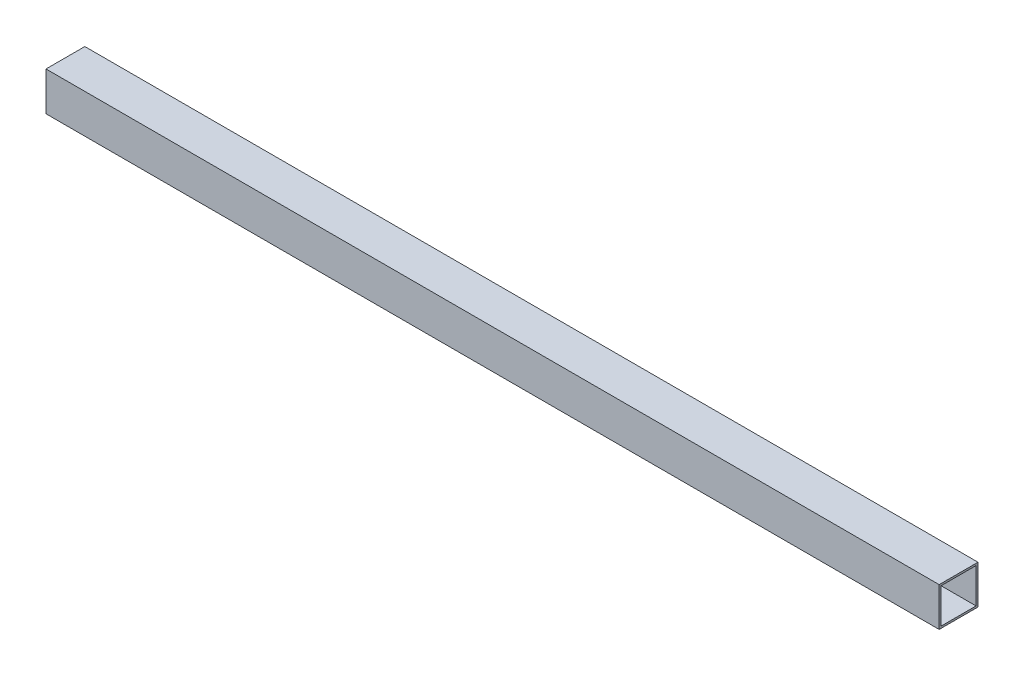
ISO-10303-21;
HEADER;
FILE_DESCRIPTION(('STEP AP214'),'2;1');
FILE_NAME('part.step','',(''),(''),'','','');
FILE_SCHEMA(('AUTOMOTIVE_DESIGN { 1 0 10303 214 1 1 1 1 }'));
ENDSEC;
DATA;
#1=APPLICATION_CONTEXT('core data for automotive mechanical design processes');
#2=APPLICATION_PROTOCOL_DEFINITION('international standard','automotive_design',2000,#1);
#3=PRODUCT_CONTEXT('',#1,'mechanical');
#4=PRODUCT('Part','Part','',(#3));
#5=PRODUCT_RELATED_PRODUCT_CATEGORY('part','',(#4));
#6=PRODUCT_DEFINITION_FORMATION('','',#4);
#7=PRODUCT_DEFINITION_CONTEXT('part definition',#1,'design');
#8=PRODUCT_DEFINITION('design','',#6,#7);
#9=PRODUCT_DEFINITION_SHAPE('','',#8);
#10=(LENGTH_UNIT() NAMED_UNIT(*) SI_UNIT(.MILLI.,.METRE.));
#11=(NAMED_UNIT(*) PLANE_ANGLE_UNIT() SI_UNIT($,.RADIAN.));
#12=(NAMED_UNIT(*) SI_UNIT($,.STERADIAN.) SOLID_ANGLE_UNIT());
#13=UNCERTAINTY_MEASURE_WITH_UNIT(LENGTH_MEASURE(1.E-05),#10,'distance_accuracy_value','');
#14=(GEOMETRIC_REPRESENTATION_CONTEXT(3) GLOBAL_UNCERTAINTY_ASSIGNED_CONTEXT((#13)) GLOBAL_UNIT_ASSIGNED_CONTEXT((#10,
#11,#12)) REPRESENTATION_CONTEXT('',''));
#15=CARTESIAN_POINT('',(0.,0.,0.));
#16=DIRECTION('',(0.,0.,1.));
#17=DIRECTION('',(1.,0.,0.));
#18=AXIS2_PLACEMENT_3D('',#15,#16,#17);
#19=CARTESIAN_POINT('',(920.,0.,0.));
#20=DIRECTION('',(-1.,0.,0.));
#21=DIRECTION('',(0.,0.,1.));
#22=AXIS2_PLACEMENT_3D('',#19,#20,#21);
#23=PLANE('',#22);
#24=DIRECTION('',(0.,1.,0.));
#25=VECTOR('',#24,1.);
#26=CARTESIAN_POINT('',(920.,-20.,-20.));
#27=LINE('',#26,#25);
#28=CARTESIAN_POINT('',(920.,-20.,-20.));
#29=VERTEX_POINT('',#28);
#30=CARTESIAN_POINT('',(920.,20.,-20.));
#31=VERTEX_POINT('',#30);
#32=EDGE_CURVE('E133',#29,#31,#27,.T.);
#33=ORIENTED_EDGE('',*,*,#32,.T.);
#34=DIRECTION('',(0.,0.,1.));
#35=VECTOR('',#34,1.);
#36=CARTESIAN_POINT('',(920.,20.,20.));
#37=LINE('',#36,#35);
#38=CARTESIAN_POINT('',(920.,20.,20.));
#39=VERTEX_POINT('',#38);
#40=EDGE_CURVE('E136',#31,#39,#37,.T.);
#41=ORIENTED_EDGE('',*,*,#40,.T.);
#42=DIRECTION('',(0.,-1.,0.));
#43=VECTOR('',#42,1.);
#44=CARTESIAN_POINT('',(920.,-20.,20.));
#45=LINE('',#44,#43);
#46=CARTESIAN_POINT('',(920.,-20.,20.));
#47=VERTEX_POINT('',#46);
#48=EDGE_CURVE('E139',#39,#47,#45,.T.);
#49=ORIENTED_EDGE('',*,*,#48,.T.);
#50=DIRECTION('',(0.,0.,-1.));
#51=VECTOR('',#50,1.);
#52=CARTESIAN_POINT('',(920.,-20.,20.));
#53=LINE('',#52,#51);
#54=EDGE_CURVE('E141',#47,#29,#53,.T.);
#55=ORIENTED_EDGE('',*,*,#54,.T.);
#56=EDGE_LOOP('',(#33,#41,#49,#55));
#57=FACE_BOUND('',#56,.T.);
#58=DIRECTION('',(0.,1.,0.));
#59=VECTOR('',#58,1.);
#60=CARTESIAN_POINT('',(920.,-18.,-18.));
#61=LINE('',#60,#59);
#62=CARTESIAN_POINT('',(920.,-18.,-18.));
#63=VERTEX_POINT('',#62);
#64=CARTESIAN_POINT('',(920.,18.,-18.));
#65=VERTEX_POINT('',#64);
#66=EDGE_CURVE('E97',#63,#65,#61,.T.);
#67=ORIENTED_EDGE('',*,*,#66,.F.);
#68=DIRECTION('',(0.,0.,-1.));
#69=VECTOR('',#68,1.);
#70=CARTESIAN_POINT('',(920.,-18.,18.));
#71=LINE('',#70,#69);
#72=CARTESIAN_POINT('',(920.,-18.,18.));
#73=VERTEX_POINT('',#72);
#74=EDGE_CURVE('E119',#73,#63,#71,.T.);
#75=ORIENTED_EDGE('',*,*,#74,.F.);
#76=DIRECTION('',(0.,-1.,0.));
#77=VECTOR('',#76,1.);
#78=CARTESIAN_POINT('',(920.,-18.,18.));
#79=LINE('',#78,#77);
#80=CARTESIAN_POINT('',(920.,18.,18.));
#81=VERTEX_POINT('',#80);
#82=EDGE_CURVE('E117',#81,#73,#79,.T.);
#83=ORIENTED_EDGE('',*,*,#82,.F.);
#84=DIRECTION('',(0.,0.,1.));
#85=VECTOR('',#84,1.);
#86=CARTESIAN_POINT('',(920.,18.,18.));
#87=LINE('',#86,#85);
#88=EDGE_CURVE('E105',#65,#81,#87,.T.);
#89=ORIENTED_EDGE('',*,*,#88,.F.);
#90=EDGE_LOOP('',(#67,#75,#83,#89));
#91=FACE_BOUND('',#90,.T.);
#92=ADVANCED_FACE('F32',(#57,#91),#23,.F.);
#93=CARTESIAN_POINT('',(0.,0.,0.));
#94=DIRECTION('',(-1.,0.,0.));
#95=DIRECTION('',(0.,0.,1.));
#96=AXIS2_PLACEMENT_3D('',#93,#94,#95);
#97=PLANE('',#96);
#98=DIRECTION('',(0.,1.,0.));
#99=VECTOR('',#98,1.);
#100=CARTESIAN_POINT('',(0.,-20.,-20.));
#101=LINE('',#100,#99);
#102=CARTESIAN_POINT('',(0.,-20.,-20.));
#103=VERTEX_POINT('',#102);
#104=CARTESIAN_POINT('',(0.,20.,-20.));
#105=VERTEX_POINT('',#104);
#106=EDGE_CURVE('E113',#103,#105,#101,.T.);
#107=ORIENTED_EDGE('',*,*,#106,.F.);
#108=DIRECTION('',(0.,0.,-1.));
#109=VECTOR('',#108,1.);
#110=CARTESIAN_POINT('',(0.,-20.,20.));
#111=LINE('',#110,#109);
#112=CARTESIAN_POINT('',(0.,-20.,20.));
#113=VERTEX_POINT('',#112);
#114=EDGE_CURVE('E137',#113,#103,#111,.T.);
#115=ORIENTED_EDGE('',*,*,#114,.F.);
#116=DIRECTION('',(0.,-1.,0.));
#117=VECTOR('',#116,1.);
#118=CARTESIAN_POINT('',(0.,-20.,20.));
#119=LINE('',#118,#117);
#120=CARTESIAN_POINT('',(0.,20.,20.));
#121=VERTEX_POINT('',#120);
#122=EDGE_CURVE('E148',#121,#113,#119,.T.);
#123=ORIENTED_EDGE('',*,*,#122,.F.);
#124=DIRECTION('',(0.,0.,1.));
#125=VECTOR('',#124,1.);
#126=CARTESIAN_POINT('',(0.,20.,20.));
#127=LINE('',#126,#125);
#128=EDGE_CURVE('E146',#105,#121,#127,.T.);
#129=ORIENTED_EDGE('',*,*,#128,.F.);
#130=EDGE_LOOP('',(#107,#115,#123,#129));
#131=FACE_BOUND('',#130,.T.);
#132=DIRECTION('',(0.,0.,-1.));
#133=VECTOR('',#132,1.);
#134=CARTESIAN_POINT('',(0.,-18.,18.));
#135=LINE('',#134,#133);
#136=CARTESIAN_POINT('',(0.,-18.,18.));
#137=VERTEX_POINT('',#136);
#138=CARTESIAN_POINT('',(0.,-18.,-18.));
#139=VERTEX_POINT('',#138);
#140=EDGE_CURVE('E106',#137,#139,#135,.T.);
#141=ORIENTED_EDGE('',*,*,#140,.T.);
#142=DIRECTION('',(0.,1.,0.));
#143=VECTOR('',#142,1.);
#144=CARTESIAN_POINT('',(0.,-18.,-18.));
#145=LINE('',#144,#143);
#146=CARTESIAN_POINT('',(0.,18.,-18.));
#147=VERTEX_POINT('',#146);
#148=EDGE_CURVE('E55',#139,#147,#145,.T.);
#149=ORIENTED_EDGE('',*,*,#148,.T.);
#150=DIRECTION('',(0.,0.,1.));
#151=VECTOR('',#150,1.);
#152=CARTESIAN_POINT('',(0.,18.,18.));
#153=LINE('',#152,#151);
#154=CARTESIAN_POINT('',(0.,18.,18.));
#155=VERTEX_POINT('',#154);
#156=EDGE_CURVE('E112',#147,#155,#153,.T.);
#157=ORIENTED_EDGE('',*,*,#156,.T.);
#158=DIRECTION('',(0.,-1.,0.));
#159=VECTOR('',#158,1.);
#160=CARTESIAN_POINT('',(0.,-18.,18.));
#161=LINE('',#160,#159);
#162=EDGE_CURVE('E125',#155,#137,#161,.T.);
#163=ORIENTED_EDGE('',*,*,#162,.T.);
#164=EDGE_LOOP('',(#141,#149,#157,#163));
#165=FACE_BOUND('',#164,.T.);
#166=ADVANCED_FACE('F166',(#131,#165),#97,.T.);
#167=CARTESIAN_POINT('',(920.,-20.,-20.));
#168=DIRECTION('',(0.,0.,1.));
#169=DIRECTION('',(1.,0.,0.));
#170=AXIS2_PLACEMENT_3D('',#167,#168,#169);
#171=PLANE('',#170);
#172=ORIENTED_EDGE('',*,*,#106,.T.);
#173=DIRECTION('',(-1.,0.,0.));
#174=VECTOR('',#173,1.);
#175=CARTESIAN_POINT('',(920.,20.,-20.));
#176=LINE('',#175,#174);
#177=EDGE_CURVE('E11',#31,#105,#176,.T.);
#178=ORIENTED_EDGE('',*,*,#177,.F.);
#179=ORIENTED_EDGE('',*,*,#32,.F.);
#180=DIRECTION('',(-1.,0.,0.));
#181=VECTOR('',#180,1.);
#182=CARTESIAN_POINT('',(920.,-20.,-20.));
#183=LINE('',#182,#181);
#184=EDGE_CURVE('E143',#29,#103,#183,.T.);
#185=ORIENTED_EDGE('',*,*,#184,.T.);
#186=EDGE_LOOP('',(#172,#178,#179,#185));
#187=FACE_BOUND('',#186,.T.);
#188=ADVANCED_FACE('F34',(#187),#171,.F.);
#189=CARTESIAN_POINT('',(920.,20.,20.));
#190=DIRECTION('',(0.,-1.,0.));
#191=DIRECTION('',(0.,0.,-1.));
#192=AXIS2_PLACEMENT_3D('',#189,#190,#191);
#193=PLANE('',#192);
#194=ORIENTED_EDGE('',*,*,#128,.T.);
#195=DIRECTION('',(-1.,0.,0.));
#196=VECTOR('',#195,1.);
#197=CARTESIAN_POINT('',(920.,20.,20.));
#198=LINE('',#197,#196);
#199=EDGE_CURVE('E40',#39,#121,#198,.T.);
#200=ORIENTED_EDGE('',*,*,#199,.F.);
#201=ORIENTED_EDGE('',*,*,#40,.F.);
#202=ORIENTED_EDGE('',*,*,#177,.T.);
#203=EDGE_LOOP('',(#194,#200,#201,#202));
#204=FACE_BOUND('',#203,.T.);
#205=ADVANCED_FACE('F176',(#204),#193,.F.);
#206=CARTESIAN_POINT('',(920.,-20.,20.));
#207=DIRECTION('',(0.,0.,-1.));
#208=DIRECTION('',(-1.,0.,0.));
#209=AXIS2_PLACEMENT_3D('',#206,#207,#208);
#210=PLANE('',#209);
#211=ORIENTED_EDGE('',*,*,#122,.T.);
#212=DIRECTION('',(-1.,0.,0.));
#213=VECTOR('',#212,1.);
#214=CARTESIAN_POINT('',(920.,-20.,20.));
#215=LINE('',#214,#213);
#216=EDGE_CURVE('E153',#47,#113,#215,.T.);
#217=ORIENTED_EDGE('',*,*,#216,.F.);
#218=ORIENTED_EDGE('',*,*,#48,.F.);
#219=ORIENTED_EDGE('',*,*,#199,.T.);
#220=EDGE_LOOP('',(#211,#217,#218,#219));
#221=FACE_BOUND('',#220,.T.);
#222=ADVANCED_FACE('F160',(#221),#210,.F.);
#223=CARTESIAN_POINT('',(920.,-20.,20.));
#224=DIRECTION('',(0.,1.,0.));
#225=DIRECTION('',(0.,0.,1.));
#226=AXIS2_PLACEMENT_3D('',#223,#224,#225);
#227=PLANE('',#226);
#228=ORIENTED_EDGE('',*,*,#114,.T.);
#229=ORIENTED_EDGE('',*,*,#184,.F.);
#230=ORIENTED_EDGE('',*,*,#54,.F.);
#231=ORIENTED_EDGE('',*,*,#216,.T.);
#232=EDGE_LOOP('',(#228,#229,#230,#231));
#233=FACE_BOUND('',#232,.T.);
#234=ADVANCED_FACE('F170',(#233),#227,.F.);
#235=CARTESIAN_POINT('',(920.,-18.,-18.));
#236=DIRECTION('',(0.,0.,1.));
#237=DIRECTION('',(1.,0.,0.));
#238=AXIS2_PLACEMENT_3D('',#235,#236,#237);
#239=PLANE('',#238);
#240=ORIENTED_EDGE('',*,*,#148,.F.);
#241=DIRECTION('',(-1.,0.,0.));
#242=VECTOR('',#241,1.);
#243=CARTESIAN_POINT('',(920.,-18.,-18.));
#244=LINE('',#243,#242);
#245=EDGE_CURVE('E101',#63,#139,#244,.T.);
#246=ORIENTED_EDGE('',*,*,#245,.F.);
#247=ORIENTED_EDGE('',*,*,#66,.T.);
#248=DIRECTION('',(-1.,0.,0.));
#249=VECTOR('',#248,1.);
#250=CARTESIAN_POINT('',(920.,18.,-18.));
#251=LINE('',#250,#249);
#252=EDGE_CURVE('E100',#65,#147,#251,.T.);
#253=ORIENTED_EDGE('',*,*,#252,.T.);
#254=EDGE_LOOP('',(#240,#246,#247,#253));
#255=FACE_BOUND('',#254,.T.);
#256=ADVANCED_FACE('F99',(#255),#239,.T.);
#257=CARTESIAN_POINT('',(920.,18.,18.));
#258=DIRECTION('',(0.,-1.,0.));
#259=DIRECTION('',(0.,0.,-1.));
#260=AXIS2_PLACEMENT_3D('',#257,#258,#259);
#261=PLANE('',#260);
#262=ORIENTED_EDGE('',*,*,#156,.F.);
#263=ORIENTED_EDGE('',*,*,#252,.F.);
#264=ORIENTED_EDGE('',*,*,#88,.T.);
#265=DIRECTION('',(-1.,0.,0.));
#266=VECTOR('',#265,1.);
#267=CARTESIAN_POINT('',(920.,18.,18.));
#268=LINE('',#267,#266);
#269=EDGE_CURVE('E114',#81,#155,#268,.T.);
#270=ORIENTED_EDGE('',*,*,#269,.T.);
#271=EDGE_LOOP('',(#262,#263,#264,#270));
#272=FACE_BOUND('',#271,.T.);
#273=ADVANCED_FACE('F109',(#272),#261,.T.);
#274=CARTESIAN_POINT('',(920.,-18.,18.));
#275=DIRECTION('',(0.,0.,-1.));
#276=DIRECTION('',(-1.,0.,0.));
#277=AXIS2_PLACEMENT_3D('',#274,#275,#276);
#278=PLANE('',#277);
#279=ORIENTED_EDGE('',*,*,#162,.F.);
#280=ORIENTED_EDGE('',*,*,#269,.F.);
#281=ORIENTED_EDGE('',*,*,#82,.T.);
#282=DIRECTION('',(-1.,0.,0.));
#283=VECTOR('',#282,1.);
#284=CARTESIAN_POINT('',(920.,-18.,18.));
#285=LINE('',#284,#283);
#286=EDGE_CURVE('E47',#73,#137,#285,.T.);
#287=ORIENTED_EDGE('',*,*,#286,.T.);
#288=EDGE_LOOP('',(#279,#280,#281,#287));
#289=FACE_BOUND('',#288,.T.);
#290=ADVANCED_FACE('F199',(#289),#278,.T.);
#291=CARTESIAN_POINT('',(920.,-18.,18.));
#292=DIRECTION('',(0.,1.,0.));
#293=DIRECTION('',(0.,0.,1.));
#294=AXIS2_PLACEMENT_3D('',#291,#292,#293);
#295=PLANE('',#294);
#296=ORIENTED_EDGE('',*,*,#140,.F.);
#297=ORIENTED_EDGE('',*,*,#286,.F.);
#298=ORIENTED_EDGE('',*,*,#74,.T.);
#299=ORIENTED_EDGE('',*,*,#245,.T.);
#300=EDGE_LOOP('',(#296,#297,#298,#299));
#301=FACE_BOUND('',#300,.T.);
#302=ADVANCED_FACE('F203',(#301),#295,.T.);
#303=CLOSED_SHELL('',(#92,#166,#188,#205,#222,#234,#256,#273,#290,#302));
#304=MANIFOLD_SOLID_BREP('B2',#303);
#305=ADVANCED_BREP_SHAPE_REPRESENTATION('',(#18,#304),#14);
#306=SHAPE_DEFINITION_REPRESENTATION(#9,#305);
ENDSEC;
END-ISO-10303-21;
